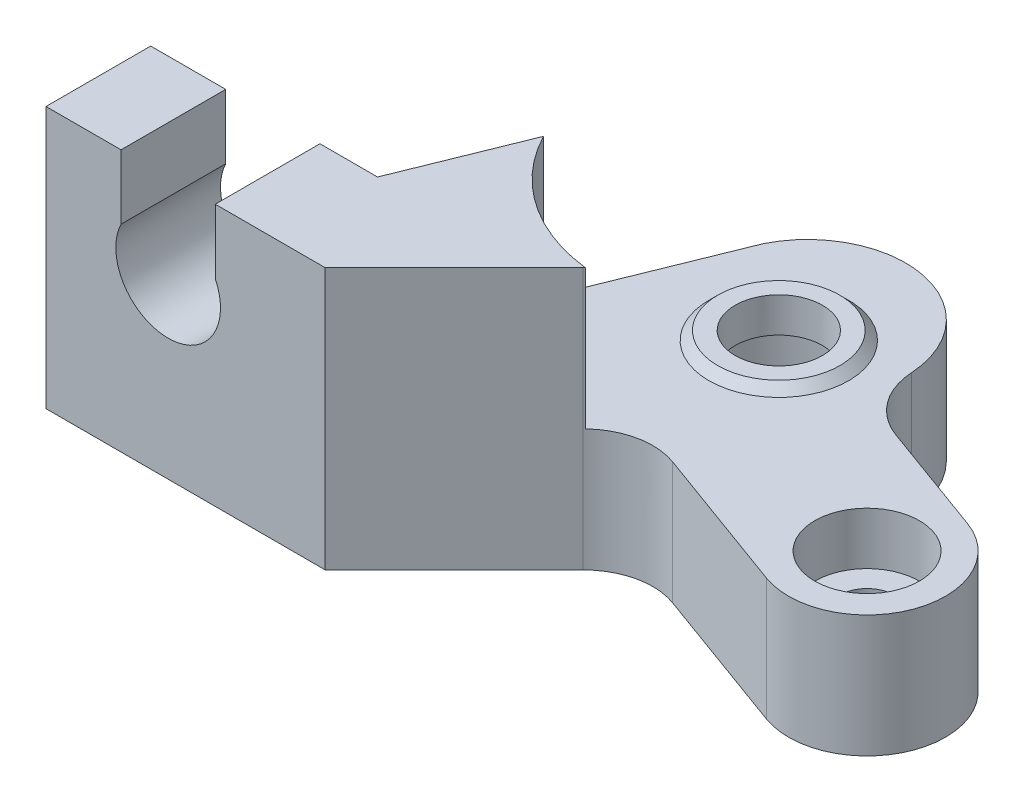
ISO-10303-21;
HEADER;
FILE_DESCRIPTION(('STEP AP214'),'2;1');
FILE_NAME('part.step','',(''),(''),'','','');
FILE_SCHEMA(('AUTOMOTIVE_DESIGN { 1 0 10303 214 1 1 1 1 }'));
ENDSEC;
DATA;
#1=APPLICATION_CONTEXT('core data for automotive mechanical design processes');
#2=APPLICATION_PROTOCOL_DEFINITION('international standard','automotive_design',2000,#1);
#3=PRODUCT_CONTEXT('',#1,'mechanical');
#4=PRODUCT('Part','Part','',(#3));
#5=PRODUCT_RELATED_PRODUCT_CATEGORY('part','',(#4));
#6=PRODUCT_DEFINITION_FORMATION('','',#4);
#7=PRODUCT_DEFINITION_CONTEXT('part definition',#1,'design');
#8=PRODUCT_DEFINITION('design','',#6,#7);
#9=PRODUCT_DEFINITION_SHAPE('','',#8);
#10=(LENGTH_UNIT() NAMED_UNIT(*) SI_UNIT(.MILLI.,.METRE.));
#11=(NAMED_UNIT(*) PLANE_ANGLE_UNIT() SI_UNIT($,.RADIAN.));
#12=(NAMED_UNIT(*) SI_UNIT($,.STERADIAN.) SOLID_ANGLE_UNIT());
#13=UNCERTAINTY_MEASURE_WITH_UNIT(LENGTH_MEASURE(1.E-05),#10,'distance_accuracy_value','');
#14=(GEOMETRIC_REPRESENTATION_CONTEXT(3) GLOBAL_UNCERTAINTY_ASSIGNED_CONTEXT((#13)) GLOBAL_UNIT_ASSIGNED_CONTEXT((#10,
#11,#12)) REPRESENTATION_CONTEXT('',''));
#15=CARTESIAN_POINT('',(0.,0.,0.));
#16=DIRECTION('',(0.,0.,1.));
#17=DIRECTION('',(1.,0.,0.));
#18=AXIS2_PLACEMENT_3D('',#15,#16,#17);
#19=CARTESIAN_POINT('',(24.3987093201029,15.,-19.2450381854957));
#20=DIRECTION('',(0.,1.,0.));
#21=DIRECTION('',(0.,0.,1.));
#22=AXIS2_PLACEMENT_3D('',#19,#20,#21);
#23=PLANE('',#22);
#24=DIRECTION('',(0.,0.,1.));
#25=VECTOR('',#24,1.);
#26=CARTESIAN_POINT('',(4.3,15.,-19.2450381854957));
#27=LINE('',#26,#25);
#28=CARTESIAN_POINT('',(4.3,15.,-6.));
#29=VERTEX_POINT('',#28);
#30=CARTESIAN_POINT('',(4.3,15.,0.));
#31=VERTEX_POINT('',#30);
#32=EDGE_CURVE('E11',#29,#31,#27,.T.);
#33=ORIENTED_EDGE('',*,*,#32,.F.);
#34=DIRECTION('',(1.,0.,0.));
#35=VECTOR('',#34,1.);
#36=CARTESIAN_POINT('',(0.,15.,-6.));
#37=LINE('',#36,#35);
#38=CARTESIAN_POINT('',(0.,15.,-6.));
#39=VERTEX_POINT('',#38);
#40=EDGE_CURVE('E222',#39,#29,#37,.T.);
#41=ORIENTED_EDGE('',*,*,#40,.F.);
#42=DIRECTION('',(0.,0.,-1.));
#43=VECTOR('',#42,1.);
#44=CARTESIAN_POINT('',(0.,15.,0.));
#45=LINE('',#44,#43);
#46=CARTESIAN_POINT('',(0.,15.,0.));
#47=VERTEX_POINT('',#46);
#48=EDGE_CURVE('E237',#47,#39,#45,.T.);
#49=ORIENTED_EDGE('',*,*,#48,.F.);
#50=DIRECTION('',(1.,0.,0.));
#51=VECTOR('',#50,1.);
#52=CARTESIAN_POINT('',(0.,15.,0.));
#53=LINE('',#52,#51);
#54=EDGE_CURVE('E234',#47,#31,#53,.T.);
#55=ORIENTED_EDGE('',*,*,#54,.T.);
#56=EDGE_LOOP('',(#33,#41,#49,#55));
#57=FACE_BOUND('',#56,.T.);
#58=ADVANCED_FACE('F33',(#57),#23,.T.);
#59=CARTESIAN_POINT('',(27.5869890474369,15.,-8.32082470778553));
#60=DIRECTION('',(0.342020143325669,0.,-0.939692620785908));
#61=DIRECTION('',(-0.939692620785908,0.,-0.342020143325669));
#62=AXIS2_PLACEMENT_3D('',#59,#60,#61);
#63=PLANE('',#62);
#64=DIRECTION('',(0.939692620785908,0.,0.342020143325669));
#65=VECTOR('',#64,1.);
#66=CARTESIAN_POINT('',(27.5869890474369,7.,-8.32082470778553));
#67=LINE('',#66,#65);
#68=CARTESIAN_POINT('',(27.5869890474369,7.,-8.32082470778553));
#69=VERTEX_POINT('',#68);
#70=CARTESIAN_POINT('',(36.0442226345101,7.,-5.24264341785451));
#71=VERTEX_POINT('',#70);
#72=EDGE_CURVE('E216',#69,#71,#67,.T.);
#73=ORIENTED_EDGE('',*,*,#72,.F.);
#74=DIRECTION('',(0.,-1.,0.));
#75=VECTOR('',#74,1.);
#76=CARTESIAN_POINT('',(27.5869890474369,15.,-8.32082470778553));
#77=LINE('',#76,#75);
#78=CARTESIAN_POINT('',(27.5869890474369,0.,-8.32082470778553));
#79=VERTEX_POINT('',#78);
#80=EDGE_CURVE('E282',#69,#79,#77,.T.);
#81=ORIENTED_EDGE('',*,*,#80,.T.);
#82=DIRECTION('',(0.939692620785908,0.,0.342020143325669));
#83=VECTOR('',#82,1.);
#84=CARTESIAN_POINT('',(27.5869890474369,0.,-8.32082470778553));
#85=LINE('',#84,#83);
#86=CARTESIAN_POINT('',(36.0442226345101,0.,-5.24264341785451));
#87=VERTEX_POINT('',#86);
#88=EDGE_CURVE('E258',#79,#87,#85,.T.);
#89=ORIENTED_EDGE('',*,*,#88,.T.);
#90=DIRECTION('',(0.,-1.,0.));
#91=VECTOR('',#90,1.);
#92=CARTESIAN_POINT('',(36.0442226345101,15.,-5.24264341785451));
#93=LINE('',#92,#91);
#94=EDGE_CURVE('E284',#71,#87,#93,.T.);
#95=ORIENTED_EDGE('',*,*,#94,.F.);
#96=EDGE_LOOP('',(#73,#81,#89,#95));
#97=FACE_BOUND('',#96,.T.);
#98=ADVANCED_FACE('F359',(#97),#63,.F.);
#99=CARTESIAN_POINT('',(37.5833132794756,15.,-9.4712602113911));
#100=DIRECTION('',(0.,-1.,0.));
#101=DIRECTION('',(0.,0.,-1.));
#102=AXIS2_PLACEMENT_3D('',#99,#100,#101);
#103=CYLINDRICAL_SURFACE('',#102,4.5);
#104=CARTESIAN_POINT('',(37.5833132794756,7.,-9.4712602113911));
#105=DIRECTION('',(0.,1.,0.));
#106=DIRECTION('',(0.,0.,1.));
#107=AXIS2_PLACEMENT_3D('',#104,#105,#106);
#108=CIRCLE('',#107,4.5);
#109=CARTESIAN_POINT('',(39.1224039244411,7.,-13.6998770049277));
#110=VERTEX_POINT('',#109);
#111=EDGE_CURVE('E214',#71,#110,#108,.T.);
#112=ORIENTED_EDGE('',*,*,#111,.F.);
#113=ORIENTED_EDGE('',*,*,#94,.T.);
#114=CARTESIAN_POINT('',(37.5833132794756,0.,-9.4712602113911));
#115=DIRECTION('',(0.,1.,0.));
#116=DIRECTION('',(0.,0.,1.));
#117=AXIS2_PLACEMENT_3D('',#114,#115,#116);
#118=CIRCLE('',#117,4.5);
#119=CARTESIAN_POINT('',(39.1224039244411,0.,-13.6998770049277));
#120=VERTEX_POINT('',#119);
#121=EDGE_CURVE('E255',#87,#120,#118,.T.);
#122=ORIENTED_EDGE('',*,*,#121,.T.);
#123=DIRECTION('',(0.,-1.,0.));
#124=VECTOR('',#123,1.);
#125=CARTESIAN_POINT('',(39.1224039244411,15.,-13.6998770049277));
#126=LINE('',#125,#124);
#127=EDGE_CURVE('E286',#110,#120,#126,.T.);
#128=ORIENTED_EDGE('',*,*,#127,.F.);
#129=EDGE_LOOP('',(#112,#113,#122,#128));
#130=FACE_BOUND('',#129,.T.);
#131=ADVANCED_FACE('F356',(#130),#103,.T.);
#132=CARTESIAN_POINT('',(39.1224039244411,15.,-13.6998770049277));
#133=DIRECTION('',(-0.342020143325669,0.,0.939692620785908));
#134=DIRECTION('',(0.939692620785908,0.,0.342020143325669));
#135=AXIS2_PLACEMENT_3D('',#132,#133,#134);
#136=PLANE('',#135);
#137=DIRECTION('',(-0.939692620785908,0.,-0.342020143325669));
#138=VECTOR('',#137,1.);
#139=CARTESIAN_POINT('',(39.1224039244411,7.,-13.6998770049277));
#140=LINE('',#139,#138);
#141=CARTESIAN_POINT('',(32.6385248410184,7.,-16.0598159938748));
#142=VERTEX_POINT('',#141);
#143=EDGE_CURVE('E212',#110,#142,#140,.T.);
#144=ORIENTED_EDGE('',*,*,#143,.F.);
#145=ORIENTED_EDGE('',*,*,#127,.T.);
#146=DIRECTION('',(-0.939692620785908,0.,-0.342020143325669));
#147=VECTOR('',#146,1.);
#148=CARTESIAN_POINT('',(39.1224039244411,0.,-13.6998770049277));
#149=LINE('',#148,#147);
#150=CARTESIAN_POINT('',(32.6385248410184,0.,-16.0598159938748));
#151=VERTEX_POINT('',#150);
#152=EDGE_CURVE('E252',#120,#151,#149,.T.);
#153=ORIENTED_EDGE('',*,*,#152,.T.);
#154=DIRECTION('',(0.,-1.,0.));
#155=VECTOR('',#154,1.);
#156=CARTESIAN_POINT('',(32.6385248410184,15.,-16.0598159938748));
#157=LINE('',#156,#155);
#158=EDGE_CURVE('E288',#142,#151,#157,.T.);
#159=ORIENTED_EDGE('',*,*,#158,.F.);
#160=EDGE_LOOP('',(#144,#145,#153,#159));
#161=FACE_BOUND('',#160,.T.);
#162=ADVANCED_FACE('F352',(#161),#136,.F.);
#163=CARTESIAN_POINT('',(34.006605414321,15.,-19.8185864770184));
#164=DIRECTION('',(0.,-1.,0.));
#165=DIRECTION('',(0.,0.,-1.));
#166=AXIS2_PLACEMENT_3D('',#163,#164,#165);
#167=CYLINDRICAL_SURFACE('',#166,4.);
#168=DIRECTION('',(0.,-1.,0.));
#169=VECTOR('',#168,1.);
#170=CARTESIAN_POINT('',(30.0137135310096,15.,-19.5802287454765));
#171=LINE('',#170,#169);
#172=CARTESIAN_POINT('',(30.0137135310096,7.,-19.5802287454765));
#173=VERTEX_POINT('',#172);
#174=CARTESIAN_POINT('',(30.0137135310096,0.,-19.5802287454765));
#175=VERTEX_POINT('',#174);
#176=EDGE_CURVE('E290',#173,#175,#171,.T.);
#177=ORIENTED_EDGE('',*,*,#176,.F.);
#178=CARTESIAN_POINT('',(34.006605414321,7.,-19.8185864770184));
#179=DIRECTION('',(0.,1.,0.));
#180=DIRECTION('',(0.,0.,1.));
#181=AXIS2_PLACEMENT_3D('',#178,#179,#180);
#182=CIRCLE('',#181,4.);
#183=EDGE_CURVE('E209',#173,#142,#182,.T.);
#184=ORIENTED_EDGE('',*,*,#183,.T.);
#185=ORIENTED_EDGE('',*,*,#158,.T.);
#186=CARTESIAN_POINT('',(34.006605414321,0.,-19.8185864770184));
#187=DIRECTION('',(0.,1.,0.));
#188=DIRECTION('',(0.,0.,1.));
#189=AXIS2_PLACEMENT_3D('',#186,#187,#188);
#190=CIRCLE('',#189,4.);
#191=EDGE_CURVE('E249',#175,#151,#190,.T.);
#192=ORIENTED_EDGE('',*,*,#191,.F.);
#193=EDGE_LOOP('',(#177,#184,#185,#192));
#194=FACE_BOUND('',#193,.T.);
#195=ADVANCED_FACE('F348',(#194),#167,.F.);
#196=CARTESIAN_POINT('',(24.3987093201029,15.,-19.2450381854957));
#197=DIRECTION('',(0.,-1.,0.));
#198=DIRECTION('',(0.,0.,-1.));
#199=AXIS2_PLACEMENT_3D('',#196,#197,#198);
#200=CYLINDRICAL_SURFACE('',#199,5.625);
#201=CARTESIAN_POINT('',(24.3987093201029,7.,-19.2450381854957));
#202=DIRECTION('',(0.,1.,0.));
#203=DIRECTION('',(0.,0.,1.));
#204=AXIS2_PLACEMENT_3D('',#201,#202,#203);
#205=CIRCLE('',#204,5.625);
#206=CARTESIAN_POINT('',(19.3683120880705,7.,-21.7621255276354));
#207=VERTEX_POINT('',#206);
#208=EDGE_CURVE('E207',#173,#207,#205,.T.);
#209=ORIENTED_EDGE('',*,*,#208,.F.);
#210=ORIENTED_EDGE('',*,*,#176,.T.);
#211=CARTESIAN_POINT('',(24.3987093201029,0.,-19.2450381854957));
#212=DIRECTION('',(0.,1.,0.));
#213=DIRECTION('',(0.,0.,1.));
#214=AXIS2_PLACEMENT_3D('',#211,#212,#213);
#215=CIRCLE('',#214,5.625);
#216=CARTESIAN_POINT('',(19.3683120880705,0.,-21.7621255276354));
#217=VERTEX_POINT('',#216);
#218=EDGE_CURVE('E246',#175,#217,#215,.T.);
#219=ORIENTED_EDGE('',*,*,#218,.T.);
#220=DIRECTION('',(0.,-1.,0.));
#221=VECTOR('',#220,1.);
#222=CARTESIAN_POINT('',(19.3683120880705,15.,-21.7621255276354));
#223=LINE('',#222,#221);
#224=EDGE_CURVE('E292',#207,#217,#223,.T.);
#225=ORIENTED_EDGE('',*,*,#224,.F.);
#226=EDGE_LOOP('',(#209,#210,#219,#225));
#227=FACE_BOUND('',#226,.T.);
#228=ADVANCED_FACE('F342',(#227),#200,.T.);
#229=CARTESIAN_POINT('',(0.,15.,-6.));
#230=DIRECTION('',(0.,0.,-1.));
#231=DIRECTION('',(-1.,0.,0.));
#232=AXIS2_PLACEMENT_3D('',#229,#230,#231);
#233=PLANE('',#232);
#234=DIRECTION('',(0.,1.,0.));
#235=VECTOR('',#234,1.);
#236=CARTESIAN_POINT('',(4.3,15.,-6.));
#237=LINE('',#236,#235);
#238=CARTESIAN_POINT('',(4.3,11.3076696830622,-6.));
#239=VERTEX_POINT('',#238);
#240=EDGE_CURVE('E179',#239,#29,#237,.T.);
#241=ORIENTED_EDGE('',*,*,#240,.F.);
#242=CARTESIAN_POINT('',(7.,10.,-6.));
#243=DIRECTION('',(0.,0.,-1.));
#244=DIRECTION('',(-1.,0.,0.));
#245=AXIS2_PLACEMENT_3D('',#242,#243,#244);
#246=CIRCLE('',#245,3.);
#247=CARTESIAN_POINT('',(9.7,11.3076696830622,-6.));
#248=VERTEX_POINT('',#247);
#249=EDGE_CURVE('E181',#248,#239,#246,.T.);
#250=ORIENTED_EDGE('',*,*,#249,.F.);
#251=DIRECTION('',(0.,-1.,0.));
#252=VECTOR('',#251,1.);
#253=CARTESIAN_POINT('',(9.7,15.,-6.));
#254=LINE('',#253,#252);
#255=CARTESIAN_POINT('',(9.7,15.,-6.));
#256=VERTEX_POINT('',#255);
#257=EDGE_CURVE('E154',#256,#248,#254,.T.);
#258=ORIENTED_EDGE('',*,*,#257,.F.);
#259=CARTESIAN_POINT('',(13.,15.,-6.));
#260=VERTEX_POINT('',#259);
#261=EDGE_CURVE('E226',#256,#260,#37,.T.);
#262=ORIENTED_EDGE('',*,*,#261,.T.);
#263=DIRECTION('',(0.,-1.,0.));
#264=VECTOR('',#263,1.);
#265=CARTESIAN_POINT('',(13.,15.,-6.));
#266=LINE('',#265,#264);
#267=CARTESIAN_POINT('',(13.,0.,-6.));
#268=VERTEX_POINT('',#267);
#269=EDGE_CURVE('E240',#260,#268,#266,.T.);
#270=ORIENTED_EDGE('',*,*,#269,.T.);
#271=DIRECTION('',(1.,0.,0.));
#272=VECTOR('',#271,1.);
#273=CARTESIAN_POINT('',(0.,0.,-6.));
#274=LINE('',#273,#272);
#275=CARTESIAN_POINT('',(0.,0.,-6.));
#276=VERTEX_POINT('',#275);
#277=EDGE_CURVE('E221',#276,#268,#274,.T.);
#278=ORIENTED_EDGE('',*,*,#277,.F.);
#279=DIRECTION('',(0.,-1.,0.));
#280=VECTOR('',#279,1.);
#281=CARTESIAN_POINT('',(0.,15.,-6.));
#282=LINE('',#281,#280);
#283=EDGE_CURVE('E272',#39,#276,#282,.T.);
#284=ORIENTED_EDGE('',*,*,#283,.F.);
#285=ORIENTED_EDGE('',*,*,#40,.T.);
#286=EDGE_LOOP('',(#241,#250,#258,#262,#270,#278,#284,#285));
#287=FACE_BOUND('',#286,.T.);
#288=ADVANCED_FACE('F35',(#287),#233,.T.);
#289=CARTESIAN_POINT('',(0.,15.,0.));
#290=DIRECTION('',(-1.,0.,0.));
#291=DIRECTION('',(0.,0.,1.));
#292=AXIS2_PLACEMENT_3D('',#289,#290,#291);
#293=PLANE('',#292);
#294=DIRECTION('',(0.,0.,-1.));
#295=VECTOR('',#294,1.);
#296=CARTESIAN_POINT('',(0.,0.,0.));
#297=LINE('',#296,#295);
#298=CARTESIAN_POINT('',(0.,0.,0.));
#299=VERTEX_POINT('',#298);
#300=EDGE_CURVE('E269',#299,#276,#297,.T.);
#301=ORIENTED_EDGE('',*,*,#300,.F.);
#302=DIRECTION('',(0.,-1.,0.));
#303=VECTOR('',#302,1.);
#304=CARTESIAN_POINT('',(0.,15.,0.));
#305=LINE('',#304,#303);
#306=EDGE_CURVE('E275',#47,#299,#305,.T.);
#307=ORIENTED_EDGE('',*,*,#306,.F.);
#308=ORIENTED_EDGE('',*,*,#48,.T.);
#309=ORIENTED_EDGE('',*,*,#283,.T.);
#310=EDGE_LOOP('',(#301,#307,#308,#309));
#311=FACE_BOUND('',#310,.T.);
#312=ADVANCED_FACE('F317',(#311),#293,.T.);
#313=CARTESIAN_POINT('',(0.,15.,0.));
#314=DIRECTION('',(0.,0.,-1.));
#315=DIRECTION('',(-1.,0.,0.));
#316=AXIS2_PLACEMENT_3D('',#313,#314,#315);
#317=PLANE('',#316);
#318=CARTESIAN_POINT('',(7.,10.,0.));
#319=DIRECTION('',(0.,0.,1.));
#320=DIRECTION('',(1.,0.,0.));
#321=AXIS2_PLACEMENT_3D('',#318,#319,#320);
#322=CIRCLE('',#321,3.);
#323=CARTESIAN_POINT('',(4.3,11.3076696830622,0.));
#324=VERTEX_POINT('',#323);
#325=CARTESIAN_POINT('',(9.7,11.3076696830622,0.));
#326=VERTEX_POINT('',#325);
#327=EDGE_CURVE('E161',#324,#326,#322,.T.);
#328=ORIENTED_EDGE('',*,*,#327,.F.);
#329=DIRECTION('',(0.,-1.,0.));
#330=VECTOR('',#329,1.);
#331=CARTESIAN_POINT('',(4.3,11.3076696830622,0.));
#332=LINE('',#331,#330);
#333=EDGE_CURVE('E158',#31,#324,#332,.T.);
#334=ORIENTED_EDGE('',*,*,#333,.F.);
#335=ORIENTED_EDGE('',*,*,#54,.F.);
#336=ORIENTED_EDGE('',*,*,#306,.T.);
#337=DIRECTION('',(1.,0.,0.));
#338=VECTOR('',#337,1.);
#339=CARTESIAN_POINT('',(0.,0.,0.));
#340=LINE('',#339,#338);
#341=CARTESIAN_POINT('',(16.,0.,0.));
#342=VERTEX_POINT('',#341);
#343=EDGE_CURVE('E267',#299,#342,#340,.T.);
#344=ORIENTED_EDGE('',*,*,#343,.T.);
#345=DIRECTION('',(0.,-1.,0.));
#346=VECTOR('',#345,1.);
#347=CARTESIAN_POINT('',(16.,15.,0.));
#348=LINE('',#347,#346);
#349=CARTESIAN_POINT('',(16.,15.,0.));
#350=VERTEX_POINT('',#349);
#351=EDGE_CURVE('E277',#350,#342,#348,.T.);
#352=ORIENTED_EDGE('',*,*,#351,.F.);
#353=CARTESIAN_POINT('',(9.7,15.,0.));
#354=VERTEX_POINT('',#353);
#355=EDGE_CURVE('E172',#354,#350,#53,.T.);
#356=ORIENTED_EDGE('',*,*,#355,.F.);
#357=DIRECTION('',(0.,1.,0.));
#358=VECTOR('',#357,1.);
#359=CARTESIAN_POINT('',(9.7,11.3076696830622,0.));
#360=LINE('',#359,#358);
#361=EDGE_CURVE('E48',#326,#354,#360,.T.);
#362=ORIENTED_EDGE('',*,*,#361,.F.);
#363=EDGE_LOOP('',(#328,#334,#335,#336,#344,#352,#356,#362));
#364=FACE_BOUND('',#363,.T.);
#365=ADVANCED_FACE('F170',(#364),#317,.F.);
#366=CARTESIAN_POINT('',(16.,15.,0.));
#367=DIRECTION('',(-0.707106781186549,0.,-0.707106781186546));
#368=DIRECTION('',(-0.707106781186546,0.,0.707106781186549));
#369=AXIS2_PLACEMENT_3D('',#366,#367,#368);
#370=PLANE('',#369);
#371=DIRECTION('',(0.707106781186546,0.,-0.707106781186549));
#372=VECTOR('',#371,1.);
#373=CARTESIAN_POINT('',(16.,0.,0.));
#374=LINE('',#373,#372);
#375=CARTESIAN_POINT('',(23.3904813493881,0.,-7.39048134938808));
#376=VERTEX_POINT('',#375);
#377=EDGE_CURVE('E264',#342,#376,#374,.T.);
#378=ORIENTED_EDGE('',*,*,#377,.T.);
#379=DIRECTION('',(0.,-1.,0.));
#380=VECTOR('',#379,1.);
#381=CARTESIAN_POINT('',(23.3904813493881,15.,-7.39048134938808));
#382=LINE('',#381,#380);
#383=CARTESIAN_POINT('',(23.3904813493881,15.,-7.39048134938808));
#384=VERTEX_POINT('',#383);
#385=EDGE_CURVE('E280',#384,#376,#382,.T.);
#386=ORIENTED_EDGE('',*,*,#385,.F.);
#387=DIRECTION('',(0.707106781186546,0.,-0.707106781186549));
#388=VECTOR('',#387,1.);
#389=CARTESIAN_POINT('',(16.,15.,0.));
#390=LINE('',#389,#388);
#391=EDGE_CURVE('E231',#350,#384,#390,.T.);
#392=ORIENTED_EDGE('',*,*,#391,.F.);
#393=ORIENTED_EDGE('',*,*,#351,.T.);
#394=EDGE_LOOP('',(#378,#386,#392,#393));
#395=FACE_BOUND('',#394,.T.);
#396=ADVANCED_FACE('F326',(#395),#370,.F.);
#397=CARTESIAN_POINT('',(26.2189084741342,15.,-4.5620542246419));
#398=DIRECTION('',(0.,-1.,0.));
#399=DIRECTION('',(0.,0.,-1.));
#400=AXIS2_PLACEMENT_3D('',#397,#398,#399);
#401=CYLINDRICAL_SURFACE('',#400,4.);
#402=DIRECTION('',(0.,1.,0.));
#403=VECTOR('',#402,1.);
#404=CARTESIAN_POINT('',(23.4540019277575,11.,-7.45260638466307));
#405=LINE('',#404,#403);
#406=CARTESIAN_POINT('',(23.4540019277575,15.,-7.45260638466307));
#407=VERTEX_POINT('',#406);
#408=CARTESIAN_POINT('',(23.4540019277575,7.,-7.45260638466307));
#409=VERTEX_POINT('',#408);
#410=EDGE_CURVE('E205',#407,#409,#405,.F.);
#411=ORIENTED_EDGE('',*,*,#410,.F.);
#412=CARTESIAN_POINT('',(26.2189084741342,15.,-4.5620542246419));
#413=DIRECTION('',(0.,1.,0.));
#414=DIRECTION('',(0.,0.,1.));
#415=AXIS2_PLACEMENT_3D('',#412,#413,#414);
#416=CIRCLE('',#415,4.);
#417=EDGE_CURVE('E229',#407,#384,#416,.T.);
#418=ORIENTED_EDGE('',*,*,#417,.T.);
#419=ORIENTED_EDGE('',*,*,#385,.T.);
#420=CARTESIAN_POINT('',(26.2189084741342,0.,-4.5620542246419));
#421=DIRECTION('',(0.,1.,0.));
#422=DIRECTION('',(0.,0.,1.));
#423=AXIS2_PLACEMENT_3D('',#420,#421,#422);
#424=CIRCLE('',#423,4.);
#425=EDGE_CURVE('E261',#79,#376,#424,.T.);
#426=ORIENTED_EDGE('',*,*,#425,.F.);
#427=ORIENTED_EDGE('',*,*,#80,.F.);
#428=CARTESIAN_POINT('',(26.2189084741342,7.,-4.5620542246419));
#429=DIRECTION('',(0.,1.,0.));
#430=DIRECTION('',(0.,0.,1.));
#431=AXIS2_PLACEMENT_3D('',#428,#429,#430);
#432=CIRCLE('',#431,4.);
#433=EDGE_CURVE('E218',#69,#409,#432,.T.);
#434=ORIENTED_EDGE('',*,*,#433,.T.);
#435=EDGE_LOOP('',(#411,#418,#419,#426,#427,#434));
#436=FACE_BOUND('',#435,.T.);
#437=ADVANCED_FACE('F334',(#436),#401,.F.);
#438=CARTESIAN_POINT('',(13.,15.,-6.));
#439=DIRECTION('',(-0.927183854566788,0.,-0.37460659341591));
#440=DIRECTION('',(-0.37460659341591,0.,0.927183854566789));
#441=AXIS2_PLACEMENT_3D('',#438,#439,#440);
#442=PLANE('',#441);
#443=DIRECTION('',(0.,1.,0.));
#444=VECTOR('',#443,1.);
#445=CARTESIAN_POINT('',(15.7370596355965,7.,-12.7744603210814));
#446=LINE('',#445,#444);
#447=CARTESIAN_POINT('',(15.7370596355965,7.,-12.7744603210814));
#448=VERTEX_POINT('',#447);
#449=CARTESIAN_POINT('',(15.7370596355965,15.,-12.7744603210814));
#450=VERTEX_POINT('',#449);
#451=EDGE_CURVE('E56',#448,#450,#446,.T.);
#452=ORIENTED_EDGE('',*,*,#451,.F.);
#453=DIRECTION('',(0.37460659341591,0.,-0.927183854566789));
#454=VECTOR('',#453,1.);
#455=CARTESIAN_POINT('',(13.,7.,-6.));
#456=LINE('',#455,#454);
#457=EDGE_CURVE('E296',#448,#207,#456,.T.);
#458=ORIENTED_EDGE('',*,*,#457,.T.);
#459=ORIENTED_EDGE('',*,*,#224,.T.);
#460=DIRECTION('',(0.37460659341591,0.,-0.927183854566788));
#461=VECTOR('',#460,1.);
#462=CARTESIAN_POINT('',(13.,0.,-6.));
#463=LINE('',#462,#461);
#464=EDGE_CURVE('E243',#268,#217,#463,.T.);
#465=ORIENTED_EDGE('',*,*,#464,.F.);
#466=ORIENTED_EDGE('',*,*,#269,.F.);
#467=DIRECTION('',(0.37460659341591,0.,-0.927183854566788));
#468=VECTOR('',#467,1.);
#469=CARTESIAN_POINT('',(13.,15.,-6.));
#470=LINE('',#469,#468);
#471=EDGE_CURVE('E225',#260,#450,#470,.T.);
#472=ORIENTED_EDGE('',*,*,#471,.T.);
#473=EDGE_LOOP('',(#452,#458,#459,#465,#466,#472));
#474=FACE_BOUND('',#473,.T.);
#475=ADVANCED_FACE('F307',(#474),#442,.T.);
#476=DIRECTION('',(0.,0.,-1.));
#477=VECTOR('',#476,1.);
#478=CARTESIAN_POINT('',(9.7,15.,-19.2450381854957));
#479=LINE('',#478,#477);
#480=EDGE_CURVE('E41',#354,#256,#479,.T.);
#481=ORIENTED_EDGE('',*,*,#480,.F.);
#482=ORIENTED_EDGE('',*,*,#355,.T.);
#483=ORIENTED_EDGE('',*,*,#391,.T.);
#484=ORIENTED_EDGE('',*,*,#417,.F.);
#485=CARTESIAN_POINT('',(24.6105183378674,15.,-17.3855047428034));
#486=DIRECTION('',(0.,1.,0.));
#487=DIRECTION('',(0.,0.,1.));
#488=AXIS2_PLACEMENT_3D('',#485,#486,#487);
#489=CIRCLE('',#488,10.);
#490=EDGE_CURVE('E274',#450,#407,#489,.T.);
#491=ORIENTED_EDGE('',*,*,#490,.F.);
#492=ORIENTED_EDGE('',*,*,#471,.F.);
#493=ORIENTED_EDGE('',*,*,#261,.F.);
#494=EDGE_LOOP('',(#481,#482,#483,#484,#491,#492,#493));
#495=FACE_BOUND('',#494,.T.);
#496=ADVANCED_FACE('F304',(#495),#23,.T.);
#497=CARTESIAN_POINT('',(24.3987093201029,0.,-19.2450381854957));
#498=DIRECTION('',(0.,1.,0.));
#499=DIRECTION('',(0.,0.,1.));
#500=AXIS2_PLACEMENT_3D('',#497,#498,#499);
#501=PLANE('',#500);
#502=CARTESIAN_POINT('',(37.5833132794756,0.,-9.4712602113911));
#503=DIRECTION('',(0.,1.,0.));
#504=DIRECTION('',(0.,0.,1.));
#505=AXIS2_PLACEMENT_3D('',#502,#503,#504);
#506=CIRCLE('',#505,1.6);
#507=CARTESIAN_POINT('',(37.5833132794756,0.,-7.8712602113911));
#508=VERTEX_POINT('',#507);
#509=EDGE_CURVE('E441',#508,#508,#506,.T.);
#510=ORIENTED_EDGE('',*,*,#509,.T.);
#511=EDGE_LOOP('',(#510));
#512=FACE_BOUND('',#511,.T.);
#513=CARTESIAN_POINT('',(24.6105183378674,0.,-17.3855047428034));
#514=DIRECTION('',(0.,-1.,0.));
#515=DIRECTION('',(0.,0.,-1.));
#516=AXIS2_PLACEMENT_3D('',#513,#514,#515);
#517=CIRCLE('',#516,4.5);
#518=CARTESIAN_POINT('',(24.6105183378674,0.,-21.8855047428034));
#519=VERTEX_POINT('',#518);
#520=EDGE_CURVE('E183',#519,#519,#517,.T.);
#521=ORIENTED_EDGE('',*,*,#520,.F.);
#522=EDGE_LOOP('',(#521));
#523=FACE_BOUND('',#522,.T.);
#524=ORIENTED_EDGE('',*,*,#277,.T.);
#525=ORIENTED_EDGE('',*,*,#464,.T.);
#526=ORIENTED_EDGE('',*,*,#218,.F.);
#527=ORIENTED_EDGE('',*,*,#191,.T.);
#528=ORIENTED_EDGE('',*,*,#152,.F.);
#529=ORIENTED_EDGE('',*,*,#121,.F.);
#530=ORIENTED_EDGE('',*,*,#88,.F.);
#531=ORIENTED_EDGE('',*,*,#425,.T.);
#532=ORIENTED_EDGE('',*,*,#377,.F.);
#533=ORIENTED_EDGE('',*,*,#343,.F.);
#534=ORIENTED_EDGE('',*,*,#300,.T.);
#535=EDGE_LOOP('',(#524,#525,#526,#527,#528,#529,#530,#531,#532,#533,#534));
#536=FACE_BOUND('',#535,.T.);
#537=ADVANCED_FACE('F314',(#512,#523,#536),#501,.F.);
#538=CARTESIAN_POINT('',(24.6105183378674,7.,-17.3855047428034));
#539=DIRECTION('',(0.,1.,0.));
#540=DIRECTION('',(0.,0.,1.));
#541=AXIS2_PLACEMENT_3D('',#538,#539,#540);
#542=CYLINDRICAL_SURFACE('',#541,10.);
#543=ORIENTED_EDGE('',*,*,#410,.T.);
#544=CARTESIAN_POINT('',(24.6105183378674,7.,-17.3855047428034));
#545=DIRECTION('',(0.,1.,0.));
#546=DIRECTION('',(0.,0.,1.));
#547=AXIS2_PLACEMENT_3D('',#544,#545,#546);
#548=CIRCLE('',#547,10.);
#549=EDGE_CURVE('E201',#448,#409,#548,.T.);
#550=ORIENTED_EDGE('',*,*,#549,.F.);
#551=ORIENTED_EDGE('',*,*,#451,.T.);
#552=ORIENTED_EDGE('',*,*,#490,.T.);
#553=EDGE_LOOP('',(#543,#550,#551,#552));
#554=FACE_BOUND('',#553,.T.);
#555=ADVANCED_FACE('F335',(#554),#542,.F.);
#556=CARTESIAN_POINT('',(24.6105183378674,7.,-17.3855047428034));
#557=DIRECTION('',(0.,1.,0.));
#558=DIRECTION('',(0.,0.,1.));
#559=AXIS2_PLACEMENT_3D('',#556,#557,#558);
#560=PLANE('',#559);
#561=CARTESIAN_POINT('',(37.5833132794756,7.,-9.4712602113911));
#562=DIRECTION('',(0.,1.,0.));
#563=DIRECTION('',(0.,0.,1.));
#564=AXIS2_PLACEMENT_3D('',#561,#562,#563);
#565=CIRCLE('',#564,3.);
#566=CARTESIAN_POINT('',(37.5833132794756,7.,-6.47126021139109));
#567=VERTEX_POINT('',#566);
#568=EDGE_CURVE('E446',#567,#567,#565,.T.);
#569=ORIENTED_EDGE('',*,*,#568,.F.);
#570=EDGE_LOOP('',(#569));
#571=FACE_BOUND('',#570,.T.);
#572=CARTESIAN_POINT('',(24.6105183378674,7.,-17.3855047428034));
#573=DIRECTION('',(0.,1.,0.));
#574=DIRECTION('',(0.,0.,1.));
#575=AXIS2_PLACEMENT_3D('',#572,#573,#574);
#576=CIRCLE('',#575,4.);
#577=CARTESIAN_POINT('',(24.6105183378674,7.,-13.3855047428034));
#578=VERTEX_POINT('',#577);
#579=EDGE_CURVE('E195',#578,#578,#576,.T.);
#580=ORIENTED_EDGE('',*,*,#579,.F.);
#581=EDGE_LOOP('',(#580));
#582=FACE_BOUND('',#581,.T.);
#583=ORIENTED_EDGE('',*,*,#72,.T.);
#584=ORIENTED_EDGE('',*,*,#111,.T.);
#585=ORIENTED_EDGE('',*,*,#143,.T.);
#586=ORIENTED_EDGE('',*,*,#183,.F.);
#587=ORIENTED_EDGE('',*,*,#208,.T.);
#588=ORIENTED_EDGE('',*,*,#457,.F.);
#589=ORIENTED_EDGE('',*,*,#549,.T.);
#590=ORIENTED_EDGE('',*,*,#433,.F.);
#591=EDGE_LOOP('',(#583,#584,#585,#586,#587,#588,#589,#590));
#592=FACE_BOUND('',#591,.T.);
#593=ADVANCED_FACE('F337',(#571,#582,#592),#560,.T.);
#594=CARTESIAN_POINT('',(24.6105183378674,7.,-17.3855047428034));
#595=DIRECTION('',(0.,-1.,0.));
#596=DIRECTION('',(0.,0.,1.));
#597=AXIS2_PLACEMENT_3D('',#594,#595,#596);
#598=CONICAL_SURFACE('',#597,4.,0.78539816339745);
#599=CARTESIAN_POINT('',(24.6105183378674,7.5,-17.3855047428034));
#600=DIRECTION('',(0.,1.,0.));
#601=DIRECTION('',(0.,0.,1.));
#602=AXIS2_PLACEMENT_3D('',#599,#600,#601);
#603=CIRCLE('',#602,3.5);
#604=CARTESIAN_POINT('',(24.6105183378674,7.5,-13.8855047428034));
#605=VERTEX_POINT('',#604);
#606=EDGE_CURVE('E198',#605,#605,#603,.T.);
#607=ORIENTED_EDGE('',*,*,#606,.F.);
#608=EDGE_LOOP('',(#607));
#609=FACE_BOUND('',#608,.T.);
#610=ORIENTED_EDGE('',*,*,#579,.T.);
#611=EDGE_LOOP('',(#610));
#612=FACE_BOUND('',#611,.T.);
#613=ADVANCED_FACE('F398',(#609,#612),#598,.T.);
#614=CARTESIAN_POINT('',(24.6105183378674,7.5,-17.3855047428034));
#615=DIRECTION('',(0.,1.,0.));
#616=DIRECTION('',(0.,0.,1.));
#617=AXIS2_PLACEMENT_3D('',#614,#615,#616);
#618=PLANE('',#617);
#619=CARTESIAN_POINT('',(24.6105183378674,7.5,-17.3855047428034));
#620=DIRECTION('',(0.,1.,0.));
#621=DIRECTION('',(0.,0.,1.));
#622=AXIS2_PLACEMENT_3D('',#619,#620,#621);
#623=CIRCLE('',#622,2.5);
#624=CARTESIAN_POINT('',(24.6105183378674,7.5,-14.8855047428034));
#625=VERTEX_POINT('',#624);
#626=EDGE_CURVE('E192',#625,#625,#623,.T.);
#627=ORIENTED_EDGE('',*,*,#626,.F.);
#628=EDGE_LOOP('',(#627));
#629=FACE_BOUND('',#628,.T.);
#630=ORIENTED_EDGE('',*,*,#606,.T.);
#631=EDGE_LOOP('',(#630));
#632=FACE_BOUND('',#631,.T.);
#633=ADVANCED_FACE('F402',(#629,#632),#618,.T.);
#634=CARTESIAN_POINT('',(24.6105183378674,5.5,-17.3855047428034));
#635=DIRECTION('',(0.,1.,0.));
#636=DIRECTION('',(0.,0.,1.));
#637=AXIS2_PLACEMENT_3D('',#634,#635,#636);
#638=CYLINDRICAL_SURFACE('',#637,2.5);
#639=CARTESIAN_POINT('',(24.6105183378674,5.5,-17.3855047428034));
#640=DIRECTION('',(0.,-1.,0.));
#641=DIRECTION('',(0.,0.,-1.));
#642=AXIS2_PLACEMENT_3D('',#639,#640,#641);
#643=CIRCLE('',#642,2.5);
#644=CARTESIAN_POINT('',(24.6105183378674,5.5,-19.8855047428034));
#645=VERTEX_POINT('',#644);
#646=EDGE_CURVE('E187',#645,#645,#643,.F.);
#647=ORIENTED_EDGE('',*,*,#646,.F.);
#648=EDGE_LOOP('',(#647));
#649=FACE_BOUND('',#648,.T.);
#650=ORIENTED_EDGE('',*,*,#626,.T.);
#651=EDGE_LOOP('',(#650));
#652=FACE_BOUND('',#651,.T.);
#653=ADVANCED_FACE('F406',(#649,#652),#638,.F.);
#654=CARTESIAN_POINT('',(24.6105183378674,5.5,-17.3855047428034));
#655=DIRECTION('',(0.,-1.,0.));
#656=DIRECTION('',(0.,0.,-1.));
#657=AXIS2_PLACEMENT_3D('',#654,#655,#656);
#658=PLANE('',#657);
#659=CARTESIAN_POINT('',(24.6105183378674,5.5,-17.3855047428034));
#660=DIRECTION('',(0.,-1.,0.));
#661=DIRECTION('',(0.,0.,-1.));
#662=AXIS2_PLACEMENT_3D('',#659,#660,#661);
#663=CIRCLE('',#662,4.5);
#664=CARTESIAN_POINT('',(24.6105183378674,5.5,-21.8855047428034));
#665=VERTEX_POINT('',#664);
#666=EDGE_CURVE('E184',#665,#665,#663,.T.);
#667=ORIENTED_EDGE('',*,*,#666,.T.);
#668=EDGE_LOOP('',(#667));
#669=FACE_BOUND('',#668,.T.);
#670=ORIENTED_EDGE('',*,*,#646,.T.);
#671=EDGE_LOOP('',(#670));
#672=FACE_BOUND('',#671,.T.);
#673=ADVANCED_FACE('F410',(#669,#672),#658,.T.);
#674=CARTESIAN_POINT('',(24.6105183378674,5.5,-17.3855047428034));
#675=DIRECTION('',(0.,-1.,0.));
#676=DIRECTION('',(0.,0.,-1.));
#677=AXIS2_PLACEMENT_3D('',#674,#675,#676);
#678=CYLINDRICAL_SURFACE('',#677,4.5);
#679=ORIENTED_EDGE('',*,*,#666,.F.);
#680=EDGE_LOOP('',(#679));
#681=FACE_BOUND('',#680,.T.);
#682=ORIENTED_EDGE('',*,*,#520,.T.);
#683=EDGE_LOOP('',(#682));
#684=FACE_BOUND('',#683,.T.);
#685=ADVANCED_FACE('F412',(#681,#684),#678,.F.);
#686=CARTESIAN_POINT('',(7.,10.,-15.));
#687=DIRECTION('',(0.,0.,1.));
#688=DIRECTION('',(1.,0.,0.));
#689=AXIS2_PLACEMENT_3D('',#686,#687,#688);
#690=CYLINDRICAL_SURFACE('',#689,3.);
#691=ORIENTED_EDGE('',*,*,#249,.T.);
#692=DIRECTION('',(0.,0.,1.));
#693=VECTOR('',#692,1.);
#694=CARTESIAN_POINT('',(4.3,11.3076696830622,-15.));
#695=LINE('',#694,#693);
#696=EDGE_CURVE('E157',#239,#324,#695,.T.);
#697=ORIENTED_EDGE('',*,*,#696,.T.);
#698=ORIENTED_EDGE('',*,*,#327,.T.);
#699=DIRECTION('',(0.,0.,1.));
#700=VECTOR('',#699,1.);
#701=CARTESIAN_POINT('',(9.7,11.3076696830622,-15.));
#702=LINE('',#701,#700);
#703=EDGE_CURVE('E150',#248,#326,#702,.T.);
#704=ORIENTED_EDGE('',*,*,#703,.F.);
#705=EDGE_LOOP('',(#691,#697,#698,#704));
#706=FACE_BOUND('',#705,.T.);
#707=ADVANCED_FACE('F162',(#706),#690,.F.);
#708=CARTESIAN_POINT('',(4.3,11.3076696830622,-15.));
#709=DIRECTION('',(-1.,0.,0.));
#710=DIRECTION('',(0.,0.,1.));
#711=AXIS2_PLACEMENT_3D('',#708,#709,#710);
#712=PLANE('',#711);
#713=ORIENTED_EDGE('',*,*,#240,.T.);
#714=ORIENTED_EDGE('',*,*,#32,.T.);
#715=ORIENTED_EDGE('',*,*,#333,.T.);
#716=ORIENTED_EDGE('',*,*,#696,.F.);
#717=EDGE_LOOP('',(#713,#714,#715,#716));
#718=FACE_BOUND('',#717,.T.);
#719=ADVANCED_FACE('F323',(#718),#712,.F.);
#720=CARTESIAN_POINT('',(9.7,11.3076696830622,-15.));
#721=DIRECTION('',(1.,0.,0.));
#722=DIRECTION('',(0.,0.,-1.));
#723=AXIS2_PLACEMENT_3D('',#720,#721,#722);
#724=PLANE('',#723);
#725=ORIENTED_EDGE('',*,*,#257,.T.);
#726=ORIENTED_EDGE('',*,*,#703,.T.);
#727=ORIENTED_EDGE('',*,*,#361,.T.);
#728=ORIENTED_EDGE('',*,*,#480,.T.);
#729=EDGE_LOOP('',(#725,#726,#727,#728));
#730=FACE_BOUND('',#729,.T.);
#731=ADVANCED_FACE('F152',(#730),#724,.F.);
#732=CARTESIAN_POINT('',(37.5833132794756,4.,-9.4712602113911));
#733=DIRECTION('',(0.,1.,0.));
#734=DIRECTION('',(0.,0.,1.));
#735=AXIS2_PLACEMENT_3D('',#732,#733,#734);
#736=CYLINDRICAL_SURFACE('',#735,3.);
#737=CARTESIAN_POINT('',(37.5833132794756,4.,-9.4712602113911));
#738=DIRECTION('',(0.,1.,0.));
#739=DIRECTION('',(0.,0.,1.));
#740=AXIS2_PLACEMENT_3D('',#737,#738,#739);
#741=CIRCLE('',#740,3.);
#742=CARTESIAN_POINT('',(37.5833132794756,4.,-6.47126021139109));
#743=VERTEX_POINT('',#742);
#744=EDGE_CURVE('E167',#743,#743,#741,.T.);
#745=ORIENTED_EDGE('',*,*,#744,.F.);
#746=EDGE_LOOP('',(#745));
#747=FACE_BOUND('',#746,.T.);
#748=ORIENTED_EDGE('',*,*,#568,.T.);
#749=EDGE_LOOP('',(#748));
#750=FACE_BOUND('',#749,.T.);
#751=ADVANCED_FACE('F423',(#747,#750),#736,.F.);
#752=CARTESIAN_POINT('',(37.5833132794756,4.,-9.4712602113911));
#753=DIRECTION('',(0.,1.,0.));
#754=DIRECTION('',(0.,0.,1.));
#755=AXIS2_PLACEMENT_3D('',#752,#753,#754);
#756=PLANE('',#755);
#757=CARTESIAN_POINT('',(37.5833132794756,4.,-9.4712602113911));
#758=DIRECTION('',(0.,1.,0.));
#759=DIRECTION('',(0.,0.,1.));
#760=AXIS2_PLACEMENT_3D('',#757,#758,#759);
#761=CIRCLE('',#760,1.6);
#762=CARTESIAN_POINT('',(37.5833132794756,4.,-7.8712602113911));
#763=VERTEX_POINT('',#762);
#764=EDGE_CURVE('E444',#763,#763,#761,.T.);
#765=ORIENTED_EDGE('',*,*,#764,.F.);
#766=EDGE_LOOP('',(#765));
#767=FACE_BOUND('',#766,.T.);
#768=ORIENTED_EDGE('',*,*,#744,.T.);
#769=EDGE_LOOP('',(#768));
#770=FACE_BOUND('',#769,.T.);
#771=ADVANCED_FACE('F428',(#767,#770),#756,.T.);
#772=CARTESIAN_POINT('',(37.5833132794756,0.,-9.4712602113911));
#773=DIRECTION('',(0.,1.,0.));
#774=DIRECTION('',(0.,0.,1.));
#775=AXIS2_PLACEMENT_3D('',#772,#773,#774);
#776=CYLINDRICAL_SURFACE('',#775,1.6);
#777=ORIENTED_EDGE('',*,*,#509,.F.);
#778=EDGE_LOOP('',(#777));
#779=FACE_BOUND('',#778,.T.);
#780=ORIENTED_EDGE('',*,*,#764,.T.);
#781=EDGE_LOOP('',(#780));
#782=FACE_BOUND('',#781,.T.);
#783=ADVANCED_FACE('F432',(#779,#782),#776,.F.);
#784=CLOSED_SHELL('',(#58,#98,#131,#162,#195,#228,#288,#312,#365,#396,#437,#475,#496,#537,#555,
#593,#613,#633,#653,#673,#685,#707,#719,#731,#751,#771,#783));
#785=MANIFOLD_SOLID_BREP('B2',#784);
#786=ADVANCED_BREP_SHAPE_REPRESENTATION('',(#18,#785),#14);
#787=SHAPE_DEFINITION_REPRESENTATION(#9,#786);
ENDSEC;
END-ISO-10303-21;
